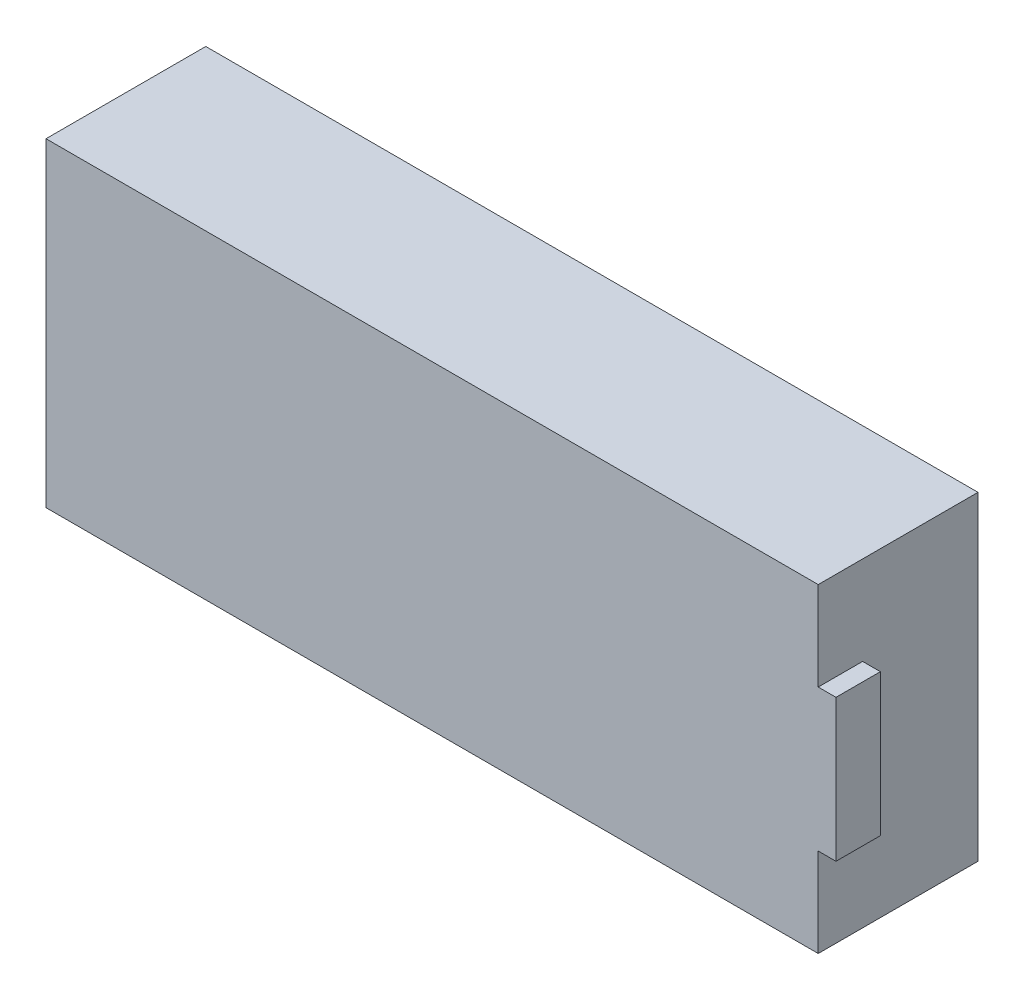
ISO-10303-21;
HEADER;
FILE_DESCRIPTION(('STEP AP214'),'2;1');
FILE_NAME('part.step','',(''),(''),'','','');
FILE_SCHEMA(('AUTOMOTIVE_DESIGN { 1 0 10303 214 1 1 1 1 }'));
ENDSEC;
DATA;
#1=APPLICATION_CONTEXT('core data for automotive mechanical design processes');
#2=APPLICATION_PROTOCOL_DEFINITION('international standard','automotive_design',2000,#1);
#3=PRODUCT_CONTEXT('',#1,'mechanical');
#4=PRODUCT('Part','Part','',(#3));
#5=PRODUCT_RELATED_PRODUCT_CATEGORY('part','',(#4));
#6=PRODUCT_DEFINITION_FORMATION('','',#4);
#7=PRODUCT_DEFINITION_CONTEXT('part definition',#1,'design');
#8=PRODUCT_DEFINITION('design','',#6,#7);
#9=PRODUCT_DEFINITION_SHAPE('','',#8);
#10=(LENGTH_UNIT() NAMED_UNIT(*) SI_UNIT(.MILLI.,.METRE.));
#11=(NAMED_UNIT(*) PLANE_ANGLE_UNIT() SI_UNIT($,.RADIAN.));
#12=(NAMED_UNIT(*) SI_UNIT($,.STERADIAN.) SOLID_ANGLE_UNIT());
#13=UNCERTAINTY_MEASURE_WITH_UNIT(LENGTH_MEASURE(1.E-05),#10,'distance_accuracy_value','');
#14=(GEOMETRIC_REPRESENTATION_CONTEXT(3) GLOBAL_UNCERTAINTY_ASSIGNED_CONTEXT((#13)) GLOBAL_UNIT_ASSIGNED_CONTEXT((#10,
#11,#12)) REPRESENTATION_CONTEXT('',''));
#15=CARTESIAN_POINT('',(0.,0.,0.));
#16=DIRECTION('',(0.,0.,1.));
#17=DIRECTION('',(1.,0.,0.));
#18=AXIS2_PLACEMENT_3D('',#15,#16,#17);
#19=CARTESIAN_POINT('',(43.5,0.,9.));
#20=DIRECTION('',(-1.,0.,0.));
#21=DIRECTION('',(0.,0.,1.));
#22=AXIS2_PLACEMENT_3D('',#19,#20,#21);
#23=PLANE('',#22);
#24=DIRECTION('',(0.,0.,-1.));
#25=VECTOR('',#24,1.);
#26=CARTESIAN_POINT('',(43.5,5.,6.5));
#27=LINE('',#26,#25);
#28=CARTESIAN_POINT('',(43.5,5.,9.));
#29=VERTEX_POINT('',#28);
#30=CARTESIAN_POINT('',(43.5,5.,6.5));
#31=VERTEX_POINT('',#30);
#32=EDGE_CURVE('E115',#29,#31,#27,.T.);
#33=ORIENTED_EDGE('',*,*,#32,.F.);
#34=DIRECTION('',(0.,1.,0.));
#35=VECTOR('',#34,1.);
#36=CARTESIAN_POINT('',(43.5,0.,9.));
#37=LINE('',#36,#35);
#38=CARTESIAN_POINT('',(43.5,0.,9.));
#39=VERTEX_POINT('',#38);
#40=EDGE_CURVE('E134',#39,#29,#37,.T.);
#41=ORIENTED_EDGE('',*,*,#40,.F.);
#42=DIRECTION('',(0.,0.,-1.));
#43=VECTOR('',#42,1.);
#44=CARTESIAN_POINT('',(43.5,0.,9.));
#45=LINE('',#44,#43);
#46=CARTESIAN_POINT('',(43.5,0.,0.));
#47=VERTEX_POINT('',#46);
#48=EDGE_CURVE('E41',#39,#47,#45,.T.);
#49=ORIENTED_EDGE('',*,*,#48,.T.);
#50=DIRECTION('',(0.,1.,0.));
#51=VECTOR('',#50,1.);
#52=CARTESIAN_POINT('',(43.5,0.,0.));
#53=LINE('',#52,#51);
#54=CARTESIAN_POINT('',(43.5,18.,0.));
#55=VERTEX_POINT('',#54);
#56=EDGE_CURVE('E141',#47,#55,#53,.T.);
#57=ORIENTED_EDGE('',*,*,#56,.T.);
#58=DIRECTION('',(0.,0.,-1.));
#59=VECTOR('',#58,1.);
#60=CARTESIAN_POINT('',(43.5,18.,9.));
#61=LINE('',#60,#59);
#62=CARTESIAN_POINT('',(43.5,18.,9.));
#63=VERTEX_POINT('',#62);
#64=EDGE_CURVE('E146',#63,#55,#61,.T.);
#65=ORIENTED_EDGE('',*,*,#64,.F.);
#66=CARTESIAN_POINT('',(43.5,13.,9.));
#67=VERTEX_POINT('',#66);
#68=EDGE_CURVE('E133',#67,#63,#37,.T.);
#69=ORIENTED_EDGE('',*,*,#68,.F.);
#70=DIRECTION('',(0.,0.,1.));
#71=VECTOR('',#70,1.);
#72=CARTESIAN_POINT('',(43.5,13.,6.5));
#73=LINE('',#72,#71);
#74=CARTESIAN_POINT('',(43.5,13.,6.5));
#75=VERTEX_POINT('',#74);
#76=EDGE_CURVE('E53',#75,#67,#73,.T.);
#77=ORIENTED_EDGE('',*,*,#76,.F.);
#78=DIRECTION('',(0.,1.,0.));
#79=VECTOR('',#78,1.);
#80=CARTESIAN_POINT('',(43.5,13.,6.5));
#81=LINE('',#80,#79);
#82=EDGE_CURVE('E48',#31,#75,#81,.T.);
#83=ORIENTED_EDGE('',*,*,#82,.F.);
#84=EDGE_LOOP('',(#33,#41,#49,#57,#65,#69,#77,#83));
#85=FACE_BOUND('',#84,.T.);
#86=ADVANCED_FACE('F33',(#85),#23,.F.);
#87=CARTESIAN_POINT('',(0.,0.,9.));
#88=DIRECTION('',(1.,0.,0.));
#89=DIRECTION('',(0.,0.,-1.));
#90=AXIS2_PLACEMENT_3D('',#87,#88,#89);
#91=PLANE('',#90);
#92=DIRECTION('',(0.,-1.,0.));
#93=VECTOR('',#92,1.);
#94=CARTESIAN_POINT('',(0.,0.,0.));
#95=LINE('',#94,#93);
#96=CARTESIAN_POINT('',(0.,18.,0.));
#97=VERTEX_POINT('',#96);
#98=CARTESIAN_POINT('',(0.,0.,0.));
#99=VERTEX_POINT('',#98);
#100=EDGE_CURVE('E118',#97,#99,#95,.T.);
#101=ORIENTED_EDGE('',*,*,#100,.T.);
#102=DIRECTION('',(0.,0.,-1.));
#103=VECTOR('',#102,1.);
#104=CARTESIAN_POINT('',(0.,0.,9.));
#105=LINE('',#104,#103);
#106=CARTESIAN_POINT('',(0.,0.,9.));
#107=VERTEX_POINT('',#106);
#108=EDGE_CURVE('E11',#107,#99,#105,.T.);
#109=ORIENTED_EDGE('',*,*,#108,.F.);
#110=DIRECTION('',(0.,-1.,0.));
#111=VECTOR('',#110,1.);
#112=CARTESIAN_POINT('',(0.,0.,9.));
#113=LINE('',#112,#111);
#114=CARTESIAN_POINT('',(0.,18.,9.));
#115=VERTEX_POINT('',#114);
#116=EDGE_CURVE('E127',#115,#107,#113,.T.);
#117=ORIENTED_EDGE('',*,*,#116,.F.);
#118=DIRECTION('',(0.,0.,-1.));
#119=VECTOR('',#118,1.);
#120=CARTESIAN_POINT('',(0.,18.,9.));
#121=LINE('',#120,#119);
#122=EDGE_CURVE('E138',#115,#97,#121,.T.);
#123=ORIENTED_EDGE('',*,*,#122,.T.);
#124=EDGE_LOOP('',(#101,#109,#117,#123));
#125=FACE_BOUND('',#124,.T.);
#126=ADVANCED_FACE('F35',(#125),#91,.F.);
#127=CARTESIAN_POINT('',(0.,0.,9.));
#128=DIRECTION('',(0.,1.,0.));
#129=DIRECTION('',(0.,0.,1.));
#130=AXIS2_PLACEMENT_3D('',#127,#128,#129);
#131=PLANE('',#130);
#132=DIRECTION('',(1.,0.,0.));
#133=VECTOR('',#132,1.);
#134=CARTESIAN_POINT('',(0.,0.,0.));
#135=LINE('',#134,#133);
#136=EDGE_CURVE('E121',#99,#47,#135,.T.);
#137=ORIENTED_EDGE('',*,*,#136,.T.);
#138=ORIENTED_EDGE('',*,*,#48,.F.);
#139=DIRECTION('',(1.,0.,0.));
#140=VECTOR('',#139,1.);
#141=CARTESIAN_POINT('',(0.,0.,9.));
#142=LINE('',#141,#140);
#143=EDGE_CURVE('E130',#107,#39,#142,.T.);
#144=ORIENTED_EDGE('',*,*,#143,.F.);
#145=ORIENTED_EDGE('',*,*,#108,.T.);
#146=EDGE_LOOP('',(#137,#138,#144,#145));
#147=FACE_BOUND('',#146,.T.);
#148=ADVANCED_FACE('F191',(#147),#131,.F.);
#149=CARTESIAN_POINT('',(0.,18.,9.));
#150=DIRECTION('',(0.,-1.,0.));
#151=DIRECTION('',(0.,0.,-1.));
#152=AXIS2_PLACEMENT_3D('',#149,#150,#151);
#153=PLANE('',#152);
#154=DIRECTION('',(-1.,0.,0.));
#155=VECTOR('',#154,1.);
#156=CARTESIAN_POINT('',(0.,18.,0.));
#157=LINE('',#156,#155);
#158=EDGE_CURVE('E131',#55,#97,#157,.T.);
#159=ORIENTED_EDGE('',*,*,#158,.T.);
#160=ORIENTED_EDGE('',*,*,#122,.F.);
#161=DIRECTION('',(-1.,0.,0.));
#162=VECTOR('',#161,1.);
#163=CARTESIAN_POINT('',(0.,18.,9.));
#164=LINE('',#163,#162);
#165=EDGE_CURVE('E137',#63,#115,#164,.T.);
#166=ORIENTED_EDGE('',*,*,#165,.F.);
#167=ORIENTED_EDGE('',*,*,#64,.T.);
#168=EDGE_LOOP('',(#159,#160,#166,#167));
#169=FACE_BOUND('',#168,.T.);
#170=ADVANCED_FACE('F160',(#169),#153,.F.);
#171=CARTESIAN_POINT('',(0.,0.,9.));
#172=DIRECTION('',(0.,0.,-1.));
#173=DIRECTION('',(-1.,0.,0.));
#174=AXIS2_PLACEMENT_3D('',#171,#172,#173);
#175=PLANE('',#174);
#176=ORIENTED_EDGE('',*,*,#116,.T.);
#177=ORIENTED_EDGE('',*,*,#143,.T.);
#178=ORIENTED_EDGE('',*,*,#40,.T.);
#179=DIRECTION('',(-1.,0.,0.));
#180=VECTOR('',#179,1.);
#181=CARTESIAN_POINT('',(44.5,5.,9.));
#182=LINE('',#181,#180);
#183=CARTESIAN_POINT('',(44.5,5.,9.));
#184=VERTEX_POINT('',#183);
#185=EDGE_CURVE('E123',#184,#29,#182,.T.);
#186=ORIENTED_EDGE('',*,*,#185,.F.);
#187=DIRECTION('',(0.,-1.,0.));
#188=VECTOR('',#187,1.);
#189=CARTESIAN_POINT('',(44.5,13.,9.));
#190=LINE('',#189,#188);
#191=CARTESIAN_POINT('',(44.5,13.,9.));
#192=VERTEX_POINT('',#191);
#193=EDGE_CURVE('E105',#192,#184,#190,.T.);
#194=ORIENTED_EDGE('',*,*,#193,.F.);
#195=DIRECTION('',(-1.,0.,0.));
#196=VECTOR('',#195,1.);
#197=CARTESIAN_POINT('',(44.5,13.,9.));
#198=LINE('',#197,#196);
#199=EDGE_CURVE('E102',#192,#67,#198,.T.);
#200=ORIENTED_EDGE('',*,*,#199,.T.);
#201=ORIENTED_EDGE('',*,*,#68,.T.);
#202=ORIENTED_EDGE('',*,*,#165,.T.);
#203=EDGE_LOOP('',(#176,#177,#178,#186,#194,#200,#201,#202));
#204=FACE_BOUND('',#203,.T.);
#205=ADVANCED_FACE('F166',(#204),#175,.F.);
#206=CARTESIAN_POINT('',(0.,0.,0.));
#207=DIRECTION('',(0.,0.,-1.));
#208=DIRECTION('',(-1.,0.,0.));
#209=AXIS2_PLACEMENT_3D('',#206,#207,#208);
#210=PLANE('',#209);
#211=ORIENTED_EDGE('',*,*,#100,.F.);
#212=ORIENTED_EDGE('',*,*,#158,.F.);
#213=ORIENTED_EDGE('',*,*,#56,.F.);
#214=ORIENTED_EDGE('',*,*,#136,.F.);
#215=EDGE_LOOP('',(#211,#212,#213,#214));
#216=FACE_BOUND('',#215,.T.);
#217=ADVANCED_FACE('F157',(#216),#210,.T.);
#218=CARTESIAN_POINT('',(44.5,13.,6.5));
#219=DIRECTION('',(0.,0.,1.));
#220=DIRECTION('',(0.,-1.,0.));
#221=AXIS2_PLACEMENT_3D('',#218,#219,#220);
#222=PLANE('',#221);
#223=ORIENTED_EDGE('',*,*,#82,.T.);
#224=DIRECTION('',(-1.,0.,0.));
#225=VECTOR('',#224,1.);
#226=CARTESIAN_POINT('',(44.5,13.,6.5));
#227=LINE('',#226,#225);
#228=CARTESIAN_POINT('',(44.5,13.,6.5));
#229=VERTEX_POINT('',#228);
#230=EDGE_CURVE('E100',#229,#75,#227,.T.);
#231=ORIENTED_EDGE('',*,*,#230,.F.);
#232=DIRECTION('',(0.,1.,0.));
#233=VECTOR('',#232,1.);
#234=CARTESIAN_POINT('',(44.5,13.,6.5));
#235=LINE('',#234,#233);
#236=CARTESIAN_POINT('',(44.5,5.,6.5));
#237=VERTEX_POINT('',#236);
#238=EDGE_CURVE('E106',#237,#229,#235,.T.);
#239=ORIENTED_EDGE('',*,*,#238,.F.);
#240=DIRECTION('',(-1.,0.,0.));
#241=VECTOR('',#240,1.);
#242=CARTESIAN_POINT('',(44.5,5.,6.5));
#243=LINE('',#242,#241);
#244=EDGE_CURVE('E172',#237,#31,#243,.T.);
#245=ORIENTED_EDGE('',*,*,#244,.T.);
#246=EDGE_LOOP('',(#223,#231,#239,#245));
#247=FACE_BOUND('',#246,.T.);
#248=ADVANCED_FACE('F117',(#247),#222,.F.);
#249=CARTESIAN_POINT('',(44.5,13.,6.5));
#250=DIRECTION('',(0.,-1.,0.));
#251=DIRECTION('',(0.,0.,-1.));
#252=AXIS2_PLACEMENT_3D('',#249,#250,#251);
#253=PLANE('',#252);
#254=ORIENTED_EDGE('',*,*,#76,.T.);
#255=ORIENTED_EDGE('',*,*,#199,.F.);
#256=DIRECTION('',(0.,0.,1.));
#257=VECTOR('',#256,1.);
#258=CARTESIAN_POINT('',(44.5,13.,6.5));
#259=LINE('',#258,#257);
#260=EDGE_CURVE('E96',#229,#192,#259,.T.);
#261=ORIENTED_EDGE('',*,*,#260,.F.);
#262=ORIENTED_EDGE('',*,*,#230,.T.);
#263=EDGE_LOOP('',(#254,#255,#261,#262));
#264=FACE_BOUND('',#263,.T.);
#265=ADVANCED_FACE('F98',(#264),#253,.F.);
#266=CARTESIAN_POINT('',(44.5,5.,6.5));
#267=DIRECTION('',(0.,1.,0.));
#268=DIRECTION('',(0.,0.,1.));
#269=AXIS2_PLACEMENT_3D('',#266,#267,#268);
#270=PLANE('',#269);
#271=ORIENTED_EDGE('',*,*,#32,.T.);
#272=ORIENTED_EDGE('',*,*,#244,.F.);
#273=DIRECTION('',(0.,0.,-1.));
#274=VECTOR('',#273,1.);
#275=CARTESIAN_POINT('',(44.5,5.,6.5));
#276=LINE('',#275,#274);
#277=EDGE_CURVE('E111',#184,#237,#276,.T.);
#278=ORIENTED_EDGE('',*,*,#277,.F.);
#279=ORIENTED_EDGE('',*,*,#185,.T.);
#280=EDGE_LOOP('',(#271,#272,#278,#279));
#281=FACE_BOUND('',#280,.T.);
#282=ADVANCED_FACE('F176',(#281),#270,.F.);
#283=CARTESIAN_POINT('',(44.5,0.,0.));
#284=DIRECTION('',(-1.,0.,0.));
#285=DIRECTION('',(0.,0.,1.));
#286=AXIS2_PLACEMENT_3D('',#283,#284,#285);
#287=PLANE('',#286);
#288=ORIENTED_EDGE('',*,*,#238,.T.);
#289=ORIENTED_EDGE('',*,*,#260,.T.);
#290=ORIENTED_EDGE('',*,*,#193,.T.);
#291=ORIENTED_EDGE('',*,*,#277,.T.);
#292=EDGE_LOOP('',(#288,#289,#290,#291));
#293=FACE_BOUND('',#292,.T.);
#294=ADVANCED_FACE('F109',(#293),#287,.F.);
#295=CLOSED_SHELL('',(#86,#126,#148,#170,#205,#217,#248,#265,#282,#294));
#296=MANIFOLD_SOLID_BREP('B2',#295);
#297=ADVANCED_BREP_SHAPE_REPRESENTATION('',(#18,#296),#14);
#298=SHAPE_DEFINITION_REPRESENTATION(#9,#297);
ENDSEC;
END-ISO-10303-21;
